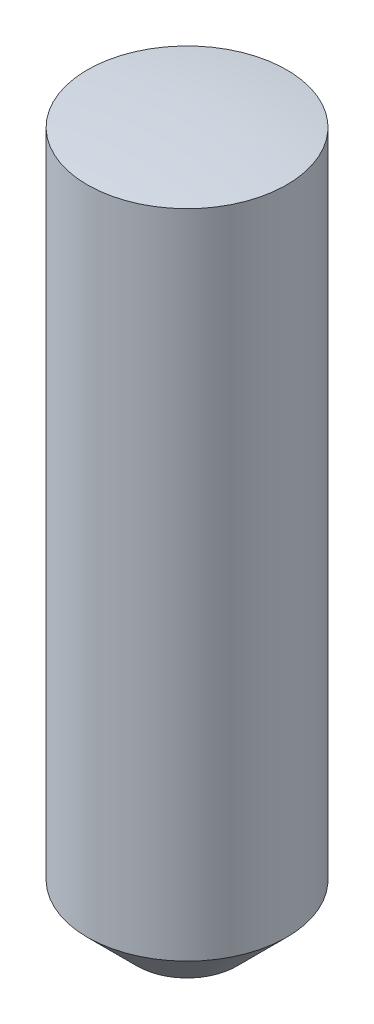
ISO-10303-21;
HEADER;
FILE_DESCRIPTION(('STEP AP214'),'2;1');
FILE_NAME('part.step','',(''),(''),'','','');
FILE_SCHEMA(('AUTOMOTIVE_DESIGN { 1 0 10303 214 1 1 1 1 }'));
ENDSEC;
DATA;
#1=APPLICATION_CONTEXT('core data for automotive mechanical design processes');
#2=APPLICATION_PROTOCOL_DEFINITION('international standard','automotive_design',2000,#1);
#3=PRODUCT_CONTEXT('',#1,'mechanical');
#4=PRODUCT('Part','Part','',(#3));
#5=PRODUCT_RELATED_PRODUCT_CATEGORY('part','',(#4));
#6=PRODUCT_DEFINITION_FORMATION('','',#4);
#7=PRODUCT_DEFINITION_CONTEXT('part definition',#1,'design');
#8=PRODUCT_DEFINITION('design','',#6,#7);
#9=PRODUCT_DEFINITION_SHAPE('','',#8);
#10=(LENGTH_UNIT() NAMED_UNIT(*) SI_UNIT(.MILLI.,.METRE.));
#11=(NAMED_UNIT(*) PLANE_ANGLE_UNIT() SI_UNIT($,.RADIAN.));
#12=(NAMED_UNIT(*) SI_UNIT($,.STERADIAN.) SOLID_ANGLE_UNIT());
#13=UNCERTAINTY_MEASURE_WITH_UNIT(LENGTH_MEASURE(1.E-05),#10,'distance_accuracy_value','');
#14=(GEOMETRIC_REPRESENTATION_CONTEXT(3) GLOBAL_UNCERTAINTY_ASSIGNED_CONTEXT((#13)) GLOBAL_UNIT_ASSIGNED_CONTEXT((#10,
#11,#12)) REPRESENTATION_CONTEXT('',''));
#15=CARTESIAN_POINT('',(0.,0.,0.));
#16=DIRECTION('',(0.,0.,1.));
#17=DIRECTION('',(1.,0.,0.));
#18=AXIS2_PLACEMENT_3D('',#15,#16,#17);
#19=CARTESIAN_POINT('',(0.,-7.1,0.));
#20=DIRECTION('',(0.,1.,0.));
#21=DIRECTION('',(0.,0.,1.));
#22=AXIS2_PLACEMENT_3D('',#19,#20,#21);
#23=PLANE('',#22);
#24=CARTESIAN_POINT('',(0.,-7.0999999999799,0.));
#25=DIRECTION('',(0.,1.,0.));
#26=DIRECTION('',(0.,0.,1.));
#27=AXIS2_PLACEMENT_3D('',#24,#25,#26);
#28=CIRCLE('',#27,0.499999999988177);
#29=CARTESIAN_POINT('',(0.,-7.0999999999799,0.499999999988177));
#30=VERTEX_POINT('',#29);
#31=EDGE_CURVE('E18',#30,#30,#28,.T.);
#32=ORIENTED_EDGE('',*,*,#31,.F.);
#33=EDGE_LOOP('',(#32));
#34=FACE_BOUND('',#33,.T.);
#35=ADVANCED_FACE('F15',(#34),#23,.F.);
#36=CARTESIAN_POINT('',(0.,-6.59999999999172,0.));
#37=DIRECTION('',(0.,1.,0.));
#38=DIRECTION('',(0.,0.,1.));
#39=AXIS2_PLACEMENT_3D('',#36,#37,#38);
#40=CONICAL_SURFACE('',#39,0.999999999976353,0.785398163397448);
#41=CARTESIAN_POINT('',(0.,-6.6,0.));
#42=DIRECTION('',(0.,1.,0.));
#43=DIRECTION('',(0.,0.,1.));
#44=AXIS2_PLACEMENT_3D('',#41,#42,#43);
#45=CIRCLE('',#44,1.);
#46=CARTESIAN_POINT('',(0.,-6.6,1.));
#47=VERTEX_POINT('',#46);
#48=EDGE_CURVE('E22',#47,#47,#45,.T.);
#49=ORIENTED_EDGE('',*,*,#48,.F.);
#50=EDGE_LOOP('',(#49));
#51=FACE_BOUND('',#50,.T.);
#52=ORIENTED_EDGE('',*,*,#31,.T.);
#53=EDGE_LOOP('',(#52));
#54=FACE_BOUND('',#53,.T.);
#55=ADVANCED_FACE('F34',(#51,#54),#40,.T.);
#56=CARTESIAN_POINT('',(0.,-8.,0.));
#57=DIRECTION('',(-1.,0.,0.));
#58=DIRECTION('',(0.,1.,0.));
#59=AXIS2_PLACEMENT_3D('',#56,#57,#58);
#60=SPHERICAL_SURFACE('',#59,8.);
#61=CARTESIAN_POINT('',(0.,-0.0627460668062279,0.));
#62=DIRECTION('',(0.,1.,0.));
#63=DIRECTION('',(0.,0.,1.));
#64=AXIS2_PLACEMENT_3D('',#61,#62,#63);
#65=CIRCLE('',#64,1.);
#66=CARTESIAN_POINT('',(0.,-0.0627460668062279,1.));
#67=VERTEX_POINT('',#66);
#68=EDGE_CURVE('E10',#67,#67,#65,.F.);
#69=ORIENTED_EDGE('',*,*,#68,.F.);
#70=EDGE_LOOP('',(#69));
#71=FACE_BOUND('',#70,.T.);
#72=ADVANCED_FACE('F30',(#71),#60,.T.);
#73=CARTESIAN_POINT('',(0.,-7.1,0.));
#74=DIRECTION('',(0.,1.,0.));
#75=DIRECTION('',(0.,0.,1.));
#76=AXIS2_PLACEMENT_3D('',#73,#74,#75);
#77=CYLINDRICAL_SURFACE('',#76,1.);
#78=ORIENTED_EDGE('',*,*,#68,.T.);
#79=EDGE_LOOP('',(#78));
#80=FACE_BOUND('',#79,.T.);
#81=ORIENTED_EDGE('',*,*,#48,.T.);
#82=EDGE_LOOP('',(#81));
#83=FACE_BOUND('',#82,.T.);
#84=ADVANCED_FACE('F33',(#80,#83),#77,.T.);
#85=CLOSED_SHELL('',(#35,#55,#72,#84));
#86=MANIFOLD_SOLID_BREP('B1',#85);
#87=ADVANCED_BREP_SHAPE_REPRESENTATION('',(#18,#86),#14);
#88=SHAPE_DEFINITION_REPRESENTATION(#9,#87);
ENDSEC;
END-ISO-10303-21;
